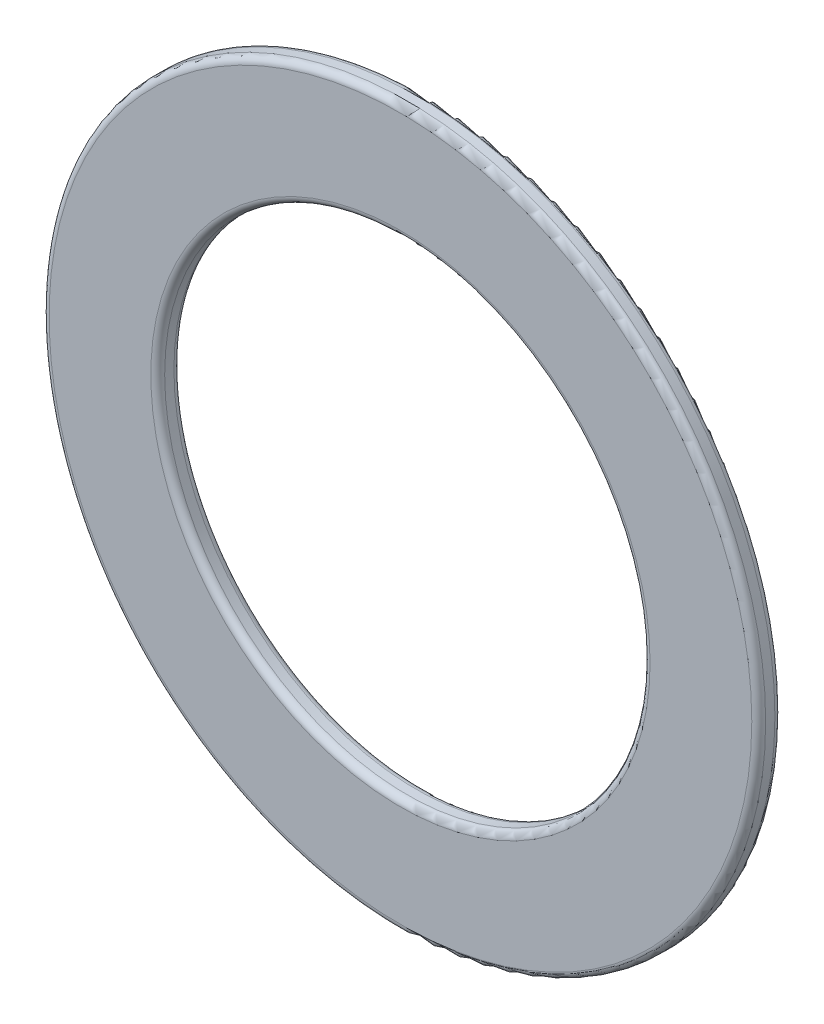
ISO-10303-21;
HEADER;
FILE_DESCRIPTION(('STEP AP214'),'2;1');
FILE_NAME('part.step','',(''),(''),'','','');
FILE_SCHEMA(('AUTOMOTIVE_DESIGN { 1 0 10303 214 1 1 1 1 }'));
ENDSEC;
DATA;
#1=APPLICATION_CONTEXT('core data for automotive mechanical design processes');
#2=APPLICATION_PROTOCOL_DEFINITION('international standard','automotive_design',2000,#1);
#3=PRODUCT_CONTEXT('',#1,'mechanical');
#4=PRODUCT('Part','Part','',(#3));
#5=PRODUCT_RELATED_PRODUCT_CATEGORY('part','',(#4));
#6=PRODUCT_DEFINITION_FORMATION('','',#4);
#7=PRODUCT_DEFINITION_CONTEXT('part definition',#1,'design');
#8=PRODUCT_DEFINITION('design','',#6,#7);
#9=PRODUCT_DEFINITION_SHAPE('','',#8);
#10=(LENGTH_UNIT() NAMED_UNIT(*) SI_UNIT(.MILLI.,.METRE.));
#11=(NAMED_UNIT(*) PLANE_ANGLE_UNIT() SI_UNIT($,.RADIAN.));
#12=(NAMED_UNIT(*) SI_UNIT($,.STERADIAN.) SOLID_ANGLE_UNIT());
#13=UNCERTAINTY_MEASURE_WITH_UNIT(LENGTH_MEASURE(1.E-05),#10,'distance_accuracy_value','');
#14=(GEOMETRIC_REPRESENTATION_CONTEXT(3) GLOBAL_UNCERTAINTY_ASSIGNED_CONTEXT((#13)) GLOBAL_UNIT_ASSIGNED_CONTEXT((#10,
#11,#12)) REPRESENTATION_CONTEXT('',''));
#15=CARTESIAN_POINT('',(0.,0.,0.));
#16=DIRECTION('',(0.,0.,1.));
#17=DIRECTION('',(1.,0.,0.));
#18=AXIS2_PLACEMENT_3D('',#15,#16,#17);
#19=CARTESIAN_POINT('',(0.,0.,-0.5));
#20=DIRECTION('',(0.,0.,1.));
#21=DIRECTION('',(1.,0.,0.));
#22=AXIS2_PLACEMENT_3D('',#19,#20,#21);
#23=CYLINDRICAL_SURFACE('',#22,7.75);
#24=CARTESIAN_POINT('',(0.,0.,-0.15));
#25=DIRECTION('',(0.,0.,1.));
#26=DIRECTION('',(1.,0.,0.));
#27=AXIS2_PLACEMENT_3D('',#24,#25,#26);
#28=CIRCLE('',#27,7.75);
#29=CARTESIAN_POINT('',(7.75,0.,-0.15));
#30=VERTEX_POINT('',#29);
#31=EDGE_CURVE('E10',#30,#30,#28,.F.);
#32=ORIENTED_EDGE('',*,*,#31,.T.);
#33=EDGE_LOOP('',(#32));
#34=FACE_BOUND('',#33,.T.);
#35=CARTESIAN_POINT('',(0.,0.,-0.35));
#36=DIRECTION('',(0.,0.,1.));
#37=DIRECTION('',(1.,0.,0.));
#38=AXIS2_PLACEMENT_3D('',#35,#36,#37);
#39=CIRCLE('',#38,7.75);
#40=CARTESIAN_POINT('',(7.75,0.,-0.35));
#41=VERTEX_POINT('',#40);
#42=EDGE_CURVE('E48',#41,#41,#39,.T.);
#43=ORIENTED_EDGE('',*,*,#42,.T.);
#44=EDGE_LOOP('',(#43));
#45=FACE_BOUND('',#44,.T.);
#46=ADVANCED_FACE('F41',(#34,#45),#23,.T.);
#47=CARTESIAN_POINT('',(0.,0.,-0.5));
#48=DIRECTION('',(0.,0.,1.));
#49=DIRECTION('',(1.,0.,0.));
#50=AXIS2_PLACEMENT_3D('',#47,#48,#49);
#51=PLANE('',#50);
#52=CARTESIAN_POINT('',(0.,0.,-0.5));
#53=DIRECTION('',(0.,0.,1.));
#54=DIRECTION('',(1.,0.,0.));
#55=AXIS2_PLACEMENT_3D('',#52,#53,#54);
#56=CIRCLE('',#55,5.4);
#57=CARTESIAN_POINT('',(5.4,0.,-0.5));
#58=VERTEX_POINT('',#57);
#59=EDGE_CURVE('E52',#58,#58,#56,.T.);
#60=ORIENTED_EDGE('',*,*,#59,.T.);
#61=EDGE_LOOP('',(#60));
#62=FACE_BOUND('',#61,.T.);
#63=CARTESIAN_POINT('',(0.,0.,-0.5));
#64=DIRECTION('',(0.,0.,1.));
#65=DIRECTION('',(1.,0.,0.));
#66=AXIS2_PLACEMENT_3D('',#63,#64,#65);
#67=CIRCLE('',#66,7.6);
#68=CARTESIAN_POINT('',(7.6,0.,-0.5));
#69=VERTEX_POINT('',#68);
#70=EDGE_CURVE('E56',#69,#69,#67,.F.);
#71=ORIENTED_EDGE('',*,*,#70,.T.);
#72=EDGE_LOOP('',(#71));
#73=FACE_BOUND('',#72,.T.);
#74=ADVANCED_FACE('F84',(#62,#73),#51,.F.);
#75=CARTESIAN_POINT('',(0.,0.,0.));
#76=DIRECTION('',(0.,0.,1.));
#77=DIRECTION('',(1.,0.,0.));
#78=AXIS2_PLACEMENT_3D('',#75,#76,#77);
#79=PLANE('',#78);
#80=CARTESIAN_POINT('',(0.,0.,0.));
#81=DIRECTION('',(0.,0.,1.));
#82=DIRECTION('',(1.,0.,0.));
#83=AXIS2_PLACEMENT_3D('',#80,#81,#82);
#84=CIRCLE('',#83,5.4);
#85=CARTESIAN_POINT('',(5.4,0.,0.));
#86=VERTEX_POINT('',#85);
#87=EDGE_CURVE('E61',#86,#86,#84,.F.);
#88=ORIENTED_EDGE('',*,*,#87,.T.);
#89=EDGE_LOOP('',(#88));
#90=FACE_BOUND('',#89,.T.);
#91=CARTESIAN_POINT('',(0.,0.,0.));
#92=DIRECTION('',(0.,0.,1.));
#93=DIRECTION('',(1.,0.,0.));
#94=AXIS2_PLACEMENT_3D('',#91,#92,#93);
#95=CIRCLE('',#94,7.6);
#96=CARTESIAN_POINT('',(7.6,0.,0.));
#97=VERTEX_POINT('',#96);
#98=EDGE_CURVE('E64',#97,#97,#95,.T.);
#99=ORIENTED_EDGE('',*,*,#98,.T.);
#100=EDGE_LOOP('',(#99));
#101=FACE_BOUND('',#100,.T.);
#102=ADVANCED_FACE('F87',(#90,#101),#79,.T.);
#103=CARTESIAN_POINT('',(0.,0.,-0.5));
#104=DIRECTION('',(0.,0.,1.));
#105=DIRECTION('',(1.,0.,0.));
#106=AXIS2_PLACEMENT_3D('',#103,#104,#105);
#107=CYLINDRICAL_SURFACE('',#106,5.25);
#108=CARTESIAN_POINT('',(0.,0.,-0.15));
#109=DIRECTION('',(0.,0.,1.));
#110=DIRECTION('',(1.,0.,0.));
#111=AXIS2_PLACEMENT_3D('',#108,#109,#110);
#112=CIRCLE('',#111,5.25);
#113=CARTESIAN_POINT('',(5.25,0.,-0.15));
#114=VERTEX_POINT('',#113);
#115=EDGE_CURVE('E67',#114,#114,#112,.T.);
#116=ORIENTED_EDGE('',*,*,#115,.T.);
#117=EDGE_LOOP('',(#116));
#118=FACE_BOUND('',#117,.T.);
#119=CARTESIAN_POINT('',(0.,0.,-0.35));
#120=DIRECTION('',(0.,0.,1.));
#121=DIRECTION('',(1.,0.,0.));
#122=AXIS2_PLACEMENT_3D('',#119,#120,#121);
#123=CIRCLE('',#122,5.25);
#124=CARTESIAN_POINT('',(5.25,0.,-0.35));
#125=VERTEX_POINT('',#124);
#126=EDGE_CURVE('E70',#125,#125,#123,.F.);
#127=ORIENTED_EDGE('',*,*,#126,.T.);
#128=EDGE_LOOP('',(#127));
#129=FACE_BOUND('',#128,.T.);
#130=ADVANCED_FACE('F74',(#118,#129),#107,.F.);
#131=CARTESIAN_POINT('',(0.,0.,-0.15));
#132=DIRECTION('',(0.,0.,1.));
#133=DIRECTION('',(1.,0.,0.));
#134=AXIS2_PLACEMENT_3D('',#131,#132,#133);
#135=TOROIDAL_SURFACE('',#134,5.4,0.15);
#136=ORIENTED_EDGE('',*,*,#87,.F.);
#137=EDGE_LOOP('',(#136));
#138=FACE_BOUND('',#137,.T.);
#139=ORIENTED_EDGE('',*,*,#115,.F.);
#140=EDGE_LOOP('',(#139));
#141=FACE_BOUND('',#140,.T.);
#142=ADVANCED_FACE('F80',(#138,#141),#135,.T.);
#143=CARTESIAN_POINT('',(0.,0.,-0.35));
#144=DIRECTION('',(0.,0.,1.));
#145=DIRECTION('',(1.,0.,0.));
#146=AXIS2_PLACEMENT_3D('',#143,#144,#145);
#147=TOROIDAL_SURFACE('',#146,5.4,0.15);
#148=ORIENTED_EDGE('',*,*,#126,.F.);
#149=EDGE_LOOP('',(#148));
#150=FACE_BOUND('',#149,.T.);
#151=ORIENTED_EDGE('',*,*,#59,.F.);
#152=EDGE_LOOP('',(#151));
#153=FACE_BOUND('',#152,.T.);
#154=ADVANCED_FACE('F76',(#150,#153),#147,.T.);
#155=CARTESIAN_POINT('',(0.,0.,-0.15));
#156=DIRECTION('',(0.,0.,1.));
#157=DIRECTION('',(1.,0.,0.));
#158=AXIS2_PLACEMENT_3D('',#155,#156,#157);
#159=TOROIDAL_SURFACE('',#158,7.6,0.15);
#160=ORIENTED_EDGE('',*,*,#31,.F.);
#161=EDGE_LOOP('',(#160));
#162=FACE_BOUND('',#161,.T.);
#163=ORIENTED_EDGE('',*,*,#98,.F.);
#164=EDGE_LOOP('',(#163));
#165=FACE_BOUND('',#164,.T.);
#166=ADVANCED_FACE('F79',(#162,#165),#159,.T.);
#167=CARTESIAN_POINT('',(0.,0.,-0.35));
#168=DIRECTION('',(0.,0.,1.));
#169=DIRECTION('',(1.,0.,0.));
#170=AXIS2_PLACEMENT_3D('',#167,#168,#169);
#171=TOROIDAL_SURFACE('',#170,7.6,0.15);
#172=ORIENTED_EDGE('',*,*,#70,.F.);
#173=EDGE_LOOP('',(#172));
#174=FACE_BOUND('',#173,.T.);
#175=ORIENTED_EDGE('',*,*,#42,.F.);
#176=EDGE_LOOP('',(#175));
#177=FACE_BOUND('',#176,.T.);
#178=ADVANCED_FACE('F43',(#174,#177),#171,.T.);
#179=CLOSED_SHELL('',(#46,#74,#102,#130,#142,#154,#166,#178));
#180=MANIFOLD_SOLID_BREP('B2',#179);
#181=ADVANCED_BREP_SHAPE_REPRESENTATION('',(#18,#180),#14);
#182=SHAPE_DEFINITION_REPRESENTATION(#9,#181);
ENDSEC;
END-ISO-10303-21;
